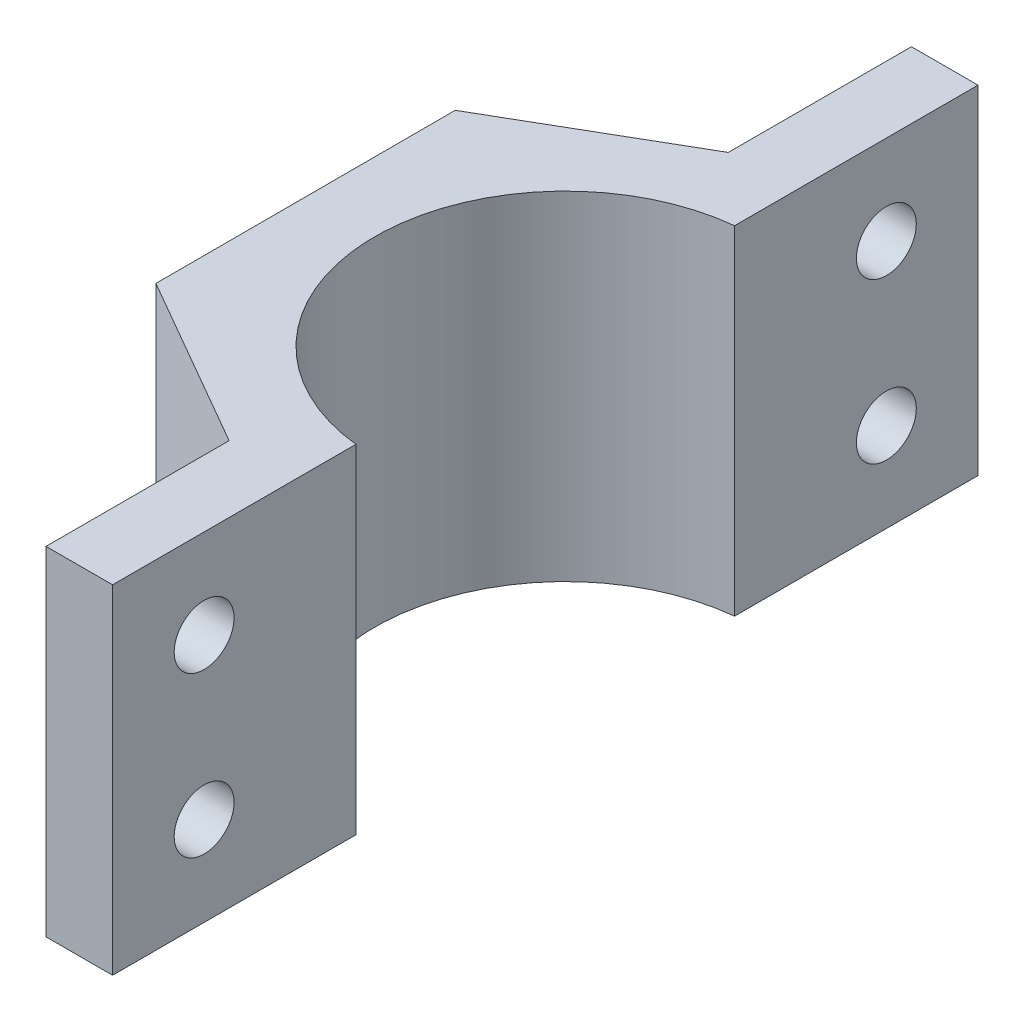
ISO-10303-21;
HEADER;
FILE_DESCRIPTION(('STEP AP214'),'2;1');
FILE_NAME('part.step','',(''),(''),'','','');
FILE_SCHEMA(('AUTOMOTIVE_DESIGN { 1 0 10303 214 1 1 1 1 }'));
ENDSEC;
DATA;
#1=APPLICATION_CONTEXT('core data for automotive mechanical design processes');
#2=APPLICATION_PROTOCOL_DEFINITION('international standard','automotive_design',2000,#1);
#3=PRODUCT_CONTEXT('',#1,'mechanical');
#4=PRODUCT('Part','Part','',(#3));
#5=PRODUCT_RELATED_PRODUCT_CATEGORY('part','',(#4));
#6=PRODUCT_DEFINITION_FORMATION('','',#4);
#7=PRODUCT_DEFINITION_CONTEXT('part definition',#1,'design');
#8=PRODUCT_DEFINITION('design','',#6,#7);
#9=PRODUCT_DEFINITION_SHAPE('','',#8);
#10=(LENGTH_UNIT() NAMED_UNIT(*) SI_UNIT(.MILLI.,.METRE.));
#11=(NAMED_UNIT(*) PLANE_ANGLE_UNIT() SI_UNIT($,.RADIAN.));
#12=(NAMED_UNIT(*) SI_UNIT($,.STERADIAN.) SOLID_ANGLE_UNIT());
#13=UNCERTAINTY_MEASURE_WITH_UNIT(LENGTH_MEASURE(1.E-05),#10,'distance_accuracy_value','');
#14=(GEOMETRIC_REPRESENTATION_CONTEXT(3) GLOBAL_UNCERTAINTY_ASSIGNED_CONTEXT((#13)) GLOBAL_UNIT_ASSIGNED_CONTEXT((#10,
#11,#12)) REPRESENTATION_CONTEXT('',''));
#15=CARTESIAN_POINT('',(0.,0.,0.));
#16=DIRECTION('',(0.,0.,1.));
#17=DIRECTION('',(1.,0.,0.));
#18=AXIS2_PLACEMENT_3D('',#15,#16,#17);
#19=CARTESIAN_POINT('',(0.,25.4,-32.5035075145393));
#20=DIRECTION('',(0.,0.,1.));
#21=DIRECTION('',(1.,0.,0.));
#22=AXIS2_PLACEMENT_3D('',#19,#20,#21);
#23=PLANE('',#22);
#24=DIRECTION('',(-1.,0.,0.));
#25=VECTOR('',#24,1.);
#26=CARTESIAN_POINT('',(0.,0.,-32.5035075145393));
#27=LINE('',#26,#25);
#28=CARTESIAN_POINT('',(-1.5,0.,-32.5035075145393));
#29=VERTEX_POINT('',#28);
#30=CARTESIAN_POINT('',(-6.5,0.,-32.5035075145393));
#31=VERTEX_POINT('',#30);
#32=EDGE_CURVE('E146',#29,#31,#27,.T.);
#33=ORIENTED_EDGE('',*,*,#32,.T.);
#34=DIRECTION('',(0.,-1.,0.));
#35=VECTOR('',#34,1.);
#36=CARTESIAN_POINT('',(-6.5,25.4,-32.5035075145393));
#37=LINE('',#36,#35);
#38=CARTESIAN_POINT('',(-6.5,25.4,-32.5035075145393));
#39=VERTEX_POINT('',#38);
#40=EDGE_CURVE('E11',#39,#31,#37,.T.);
#41=ORIENTED_EDGE('',*,*,#40,.F.);
#42=DIRECTION('',(-1.,0.,0.));
#43=VECTOR('',#42,1.);
#44=CARTESIAN_POINT('',(0.,25.4,-32.5035075145393));
#45=LINE('',#44,#43);
#46=CARTESIAN_POINT('',(-1.5,25.4,-32.5035075145393));
#47=VERTEX_POINT('',#46);
#48=EDGE_CURVE('E169',#47,#39,#45,.T.);
#49=ORIENTED_EDGE('',*,*,#48,.F.);
#50=DIRECTION('',(0.,-1.,0.));
#51=VECTOR('',#50,1.);
#52=CARTESIAN_POINT('',(-1.5,25.4,-32.5035075145393));
#53=LINE('',#52,#51);
#54=EDGE_CURVE('E142',#47,#29,#53,.T.);
#55=ORIENTED_EDGE('',*,*,#54,.T.);
#56=EDGE_LOOP('',(#33,#41,#49,#55));
#57=FACE_BOUND('',#56,.T.);
#58=ADVANCED_FACE('F39',(#57),#23,.F.);
#59=CARTESIAN_POINT('',(-6.5,25.4,0.));
#60=DIRECTION('',(1.,0.,0.));
#61=DIRECTION('',(0.,0.,-1.));
#62=AXIS2_PLACEMENT_3D('',#59,#60,#61);
#63=PLANE('',#62);
#64=CARTESIAN_POINT('',(-6.5,18.7,-25.620108633731));
#65=DIRECTION('',(1.,0.,0.));
#66=DIRECTION('',(0.,0.,-1.));
#67=AXIS2_PLACEMENT_3D('',#64,#65,#66);
#68=CIRCLE('',#67,2.25);
#69=CARTESIAN_POINT('',(-6.5,18.7,-27.870108633731));
#70=VERTEX_POINT('',#69);
#71=EDGE_CURVE('E271',#70,#70,#68,.T.);
#72=ORIENTED_EDGE('',*,*,#71,.T.);
#73=EDGE_LOOP('',(#72));
#74=FACE_BOUND('',#73,.T.);
#75=CARTESIAN_POINT('',(-6.5,6.7,-25.620108633731));
#76=DIRECTION('',(1.,0.,0.));
#77=DIRECTION('',(0.,0.,-1.));
#78=AXIS2_PLACEMENT_3D('',#75,#76,#77);
#79=CIRCLE('',#78,2.25);
#80=CARTESIAN_POINT('',(-6.5,6.7,-27.870108633731));
#81=VERTEX_POINT('',#80);
#82=EDGE_CURVE('E279',#81,#81,#79,.T.);
#83=ORIENTED_EDGE('',*,*,#82,.T.);
#84=EDGE_LOOP('',(#83));
#85=FACE_BOUND('',#84,.T.);
#86=DIRECTION('',(0.,0.,1.));
#87=VECTOR('',#86,1.);
#88=CARTESIAN_POINT('',(-6.5,0.,0.));
#89=LINE('',#88,#87);
#90=CARTESIAN_POINT('',(-6.5,0.,-18.7507398110798));
#91=VERTEX_POINT('',#90);
#92=EDGE_CURVE('E149',#31,#91,#89,.T.);
#93=ORIENTED_EDGE('',*,*,#92,.T.);
#94=DIRECTION('',(0.,-1.,0.));
#95=VECTOR('',#94,1.);
#96=CARTESIAN_POINT('',(-6.5,25.4,-18.7507398110798));
#97=LINE('',#96,#95);
#98=CARTESIAN_POINT('',(-6.5,25.4,-18.7507398110798));
#99=VERTEX_POINT('',#98);
#100=EDGE_CURVE('E47',#99,#91,#97,.T.);
#101=ORIENTED_EDGE('',*,*,#100,.F.);
#102=DIRECTION('',(0.,0.,1.));
#103=VECTOR('',#102,1.);
#104=CARTESIAN_POINT('',(-6.5,25.4,0.));
#105=LINE('',#104,#103);
#106=EDGE_CURVE('E100',#39,#99,#105,.T.);
#107=ORIENTED_EDGE('',*,*,#106,.F.);
#108=ORIENTED_EDGE('',*,*,#40,.T.);
#109=EDGE_LOOP('',(#93,#101,#107,#108));
#110=FACE_BOUND('',#109,.T.);
#111=ADVANCED_FACE('F231',(#74,#85,#110),#63,.F.);
#112=CARTESIAN_POINT('',(-9.75647202403235,25.4,-16.8670908470985));
#113=DIRECTION('',(0.500702377725878,0.,0.865619505868284));
#114=DIRECTION('',(0.865619505868284,0.,-0.500702377725878));
#115=AXIS2_PLACEMENT_3D('',#112,#113,#114);
#116=PLANE('',#115);
#117=DIRECTION('',(-0.865619505868284,0.,0.500702377725878));
#118=VECTOR('',#117,1.);
#119=CARTESIAN_POINT('',(-9.75647202403235,0.,-16.8670908470985));
#120=LINE('',#119,#118);
#121=CARTESIAN_POINT('',(-19.4946914650506,0.,-11.2341890976824));
#122=VERTEX_POINT('',#121);
#123=EDGE_CURVE('E152',#91,#122,#120,.T.);
#124=ORIENTED_EDGE('',*,*,#123,.T.);
#125=DIRECTION('',(0.,-1.,0.));
#126=VECTOR('',#125,1.);
#127=CARTESIAN_POINT('',(-19.4946914650506,25.4,-11.2341890976824));
#128=LINE('',#127,#126);
#129=CARTESIAN_POINT('',(-19.4946914650506,25.4,-11.2341890976824));
#130=VERTEX_POINT('',#129);
#131=EDGE_CURVE('E180',#130,#122,#128,.T.);
#132=ORIENTED_EDGE('',*,*,#131,.F.);
#133=DIRECTION('',(-0.865619505868284,0.,0.500702377725878));
#134=VECTOR('',#133,1.);
#135=CARTESIAN_POINT('',(-9.75647202403235,25.4,-16.8670908470985));
#136=LINE('',#135,#134);
#137=EDGE_CURVE('E188',#99,#130,#136,.T.);
#138=ORIENTED_EDGE('',*,*,#137,.F.);
#139=ORIENTED_EDGE('',*,*,#100,.T.);
#140=EDGE_LOOP('',(#124,#132,#138,#139));
#141=FACE_BOUND('',#140,.T.);
#142=ADVANCED_FACE('F186',(#141),#116,.F.);
#143=CARTESIAN_POINT('',(-19.4855651735435,25.4,0.0158072005749479));
#144=DIRECTION('',(0.999999670956206,0.,-0.000811225911740494));
#145=DIRECTION('',(-0.000811225911740494,0.,-0.999999670956206));
#146=AXIS2_PLACEMENT_3D('',#143,#144,#145);
#147=PLANE('',#146);
#148=DIRECTION('',(0.000811225911740494,0.,0.999999670956206));
#149=VECTOR('',#148,1.);
#150=CARTESIAN_POINT('',(-19.4855651735435,0.,0.0158072005749479));
#151=LINE('',#150,#149);
#152=CARTESIAN_POINT('',(-19.4764388820364,0.,11.2658034988323));
#153=VERTEX_POINT('',#152);
#154=EDGE_CURVE('E154',#122,#153,#151,.T.);
#155=ORIENTED_EDGE('',*,*,#154,.T.);
#156=DIRECTION('',(0.,-1.,0.));
#157=VECTOR('',#156,1.);
#158=CARTESIAN_POINT('',(-19.4764388820364,25.4,11.2658034988323));
#159=LINE('',#158,#157);
#160=CARTESIAN_POINT('',(-19.4764388820364,25.4,11.2658034988323));
#161=VERTEX_POINT('',#160);
#162=EDGE_CURVE('E177',#161,#153,#159,.T.);
#163=ORIENTED_EDGE('',*,*,#162,.F.);
#164=DIRECTION('',(0.000811225911740494,0.,0.999999670956206));
#165=VECTOR('',#164,1.);
#166=CARTESIAN_POINT('',(-19.4855651735435,25.4,0.0158072005749479));
#167=LINE('',#166,#165);
#168=EDGE_CURVE('E205',#130,#161,#167,.T.);
#169=ORIENTED_EDGE('',*,*,#168,.F.);
#170=ORIENTED_EDGE('',*,*,#131,.T.);
#171=EDGE_LOOP('',(#155,#163,#169,#170));
#172=FACE_BOUND('',#171,.T.);
#173=ADVANCED_FACE('F196',(#172),#147,.F.);
#174=CARTESIAN_POINT('',(-9.72909314951112,25.4,16.8828980476734));
#175=DIRECTION('',(0.499297293230328,0.,-0.866430731780024));
#176=DIRECTION('',(-0.866430731780024,0.,-0.499297293230328));
#177=AXIS2_PLACEMENT_3D('',#174,#175,#176);
#178=PLANE('',#177);
#179=DIRECTION('',(0.866430731780024,0.,0.499297293230328));
#180=VECTOR('',#179,1.);
#181=CARTESIAN_POINT('',(-9.72909314951112,0.,16.8828980476734));
#182=LINE('',#181,#180);
#183=CARTESIAN_POINT('',(-6.5,0.,18.7437247820013));
#184=VERTEX_POINT('',#183);
#185=EDGE_CURVE('E156',#153,#184,#182,.T.);
#186=ORIENTED_EDGE('',*,*,#185,.T.);
#187=DIRECTION('',(0.,-1.,0.));
#188=VECTOR('',#187,1.);
#189=CARTESIAN_POINT('',(-6.5,25.4,18.7437247820013));
#190=LINE('',#189,#188);
#191=CARTESIAN_POINT('',(-6.5,25.4,18.7437247820013));
#192=VERTEX_POINT('',#191);
#193=EDGE_CURVE('E175',#192,#184,#190,.T.);
#194=ORIENTED_EDGE('',*,*,#193,.F.);
#195=DIRECTION('',(0.866430731780024,0.,0.499297293230328));
#196=VECTOR('',#195,1.);
#197=CARTESIAN_POINT('',(-9.72909314951112,25.4,16.8828980476734));
#198=LINE('',#197,#196);
#199=EDGE_CURVE('E202',#161,#192,#198,.T.);
#200=ORIENTED_EDGE('',*,*,#199,.F.);
#201=ORIENTED_EDGE('',*,*,#162,.T.);
#202=EDGE_LOOP('',(#186,#194,#200,#201));
#203=FACE_BOUND('',#202,.T.);
#204=ADVANCED_FACE('F200',(#203),#178,.F.);
#205=CARTESIAN_POINT('',(-6.5,25.4,0.));
#206=DIRECTION('',(-1.,0.,0.));
#207=DIRECTION('',(0.,0.,1.));
#208=AXIS2_PLACEMENT_3D('',#205,#206,#207);
#209=PLANE('',#208);
#210=CARTESIAN_POINT('',(-6.5,18.7,25.620108633731));
#211=DIRECTION('',(-1.,0.,0.));
#212=DIRECTION('',(0.,0.,1.));
#213=AXIS2_PLACEMENT_3D('',#210,#211,#212);
#214=CIRCLE('',#213,2.25);
#215=CARTESIAN_POINT('',(-6.5,18.7,27.870108633731));
#216=VERTEX_POINT('',#215);
#217=EDGE_CURVE('E268',#216,#216,#214,.T.);
#218=ORIENTED_EDGE('',*,*,#217,.F.);
#219=EDGE_LOOP('',(#218));
#220=FACE_BOUND('',#219,.T.);
#221=CARTESIAN_POINT('',(-6.5,6.7,25.620108633731));
#222=DIRECTION('',(-1.,0.,0.));
#223=DIRECTION('',(0.,0.,1.));
#224=AXIS2_PLACEMENT_3D('',#221,#222,#223);
#225=CIRCLE('',#224,2.25);
#226=CARTESIAN_POINT('',(-6.5,6.7,27.870108633731));
#227=VERTEX_POINT('',#226);
#228=EDGE_CURVE('E264',#227,#227,#225,.T.);
#229=ORIENTED_EDGE('',*,*,#228,.F.);
#230=EDGE_LOOP('',(#229));
#231=FACE_BOUND('',#230,.T.);
#232=DIRECTION('',(0.,0.,-1.));
#233=VECTOR('',#232,1.);
#234=CARTESIAN_POINT('',(-6.5,0.,0.));
#235=LINE('',#234,#233);
#236=CARTESIAN_POINT('',(-6.5,0.,32.4964924854607));
#237=VERTEX_POINT('',#236);
#238=EDGE_CURVE('E159',#237,#184,#235,.T.);
#239=ORIENTED_EDGE('',*,*,#238,.F.);
#240=DIRECTION('',(0.,-1.,0.));
#241=VECTOR('',#240,1.);
#242=CARTESIAN_POINT('',(-6.5,25.4,32.4964924854607));
#243=LINE('',#242,#241);
#244=CARTESIAN_POINT('',(-6.5,25.4,32.4964924854607));
#245=VERTEX_POINT('',#244);
#246=EDGE_CURVE('E173',#245,#237,#243,.T.);
#247=ORIENTED_EDGE('',*,*,#246,.F.);
#248=DIRECTION('',(0.,0.,-1.));
#249=VECTOR('',#248,1.);
#250=CARTESIAN_POINT('',(-6.5,25.4,0.));
#251=LINE('',#250,#249);
#252=EDGE_CURVE('E204',#245,#192,#251,.T.);
#253=ORIENTED_EDGE('',*,*,#252,.T.);
#254=ORIENTED_EDGE('',*,*,#193,.T.);
#255=EDGE_LOOP('',(#239,#247,#253,#254));
#256=FACE_BOUND('',#255,.T.);
#257=ADVANCED_FACE('F247',(#220,#231,#256),#209,.T.);
#258=CARTESIAN_POINT('',(0.,25.4,32.4964924854607));
#259=DIRECTION('',(0.,0.,1.));
#260=DIRECTION('',(1.,0.,0.));
#261=AXIS2_PLACEMENT_3D('',#258,#259,#260);
#262=PLANE('',#261);
#263=DIRECTION('',(-1.,0.,0.));
#264=VECTOR('',#263,1.);
#265=CARTESIAN_POINT('',(0.,0.,32.4964924854607));
#266=LINE('',#265,#264);
#267=CARTESIAN_POINT('',(-1.5,0.,32.4964924854607));
#268=VERTEX_POINT('',#267);
#269=EDGE_CURVE('E162',#268,#237,#266,.T.);
#270=ORIENTED_EDGE('',*,*,#269,.F.);
#271=DIRECTION('',(0.,-1.,0.));
#272=VECTOR('',#271,1.);
#273=CARTESIAN_POINT('',(-1.5,25.4,32.4964924854607));
#274=LINE('',#273,#272);
#275=CARTESIAN_POINT('',(-1.5,25.4,32.4964924854607));
#276=VERTEX_POINT('',#275);
#277=EDGE_CURVE('E131',#276,#268,#274,.T.);
#278=ORIENTED_EDGE('',*,*,#277,.F.);
#279=DIRECTION('',(-1.,0.,0.));
#280=VECTOR('',#279,1.);
#281=CARTESIAN_POINT('',(0.,25.4,32.4964924854607));
#282=LINE('',#281,#280);
#283=EDGE_CURVE('E138',#276,#245,#282,.T.);
#284=ORIENTED_EDGE('',*,*,#283,.T.);
#285=ORIENTED_EDGE('',*,*,#246,.T.);
#286=EDGE_LOOP('',(#270,#278,#284,#285));
#287=FACE_BOUND('',#286,.T.);
#288=ADVANCED_FACE('F212',(#287),#262,.T.);
#289=CARTESIAN_POINT('',(-1.5,25.4,0.));
#290=DIRECTION('',(1.,0.,0.));
#291=DIRECTION('',(0.,0.,-1.));
#292=AXIS2_PLACEMENT_3D('',#289,#290,#291);
#293=PLANE('',#292);
#294=CARTESIAN_POINT('',(-1.5,18.7,25.620108633731));
#295=DIRECTION('',(-1.,0.,0.));
#296=DIRECTION('',(0.,0.,1.));
#297=AXIS2_PLACEMENT_3D('',#294,#295,#296);
#298=CIRCLE('',#297,2.25);
#299=CARTESIAN_POINT('',(-1.5,18.7,27.870108633731));
#300=VERTEX_POINT('',#299);
#301=EDGE_CURVE('E150',#300,#300,#298,.T.);
#302=ORIENTED_EDGE('',*,*,#301,.T.);
#303=EDGE_LOOP('',(#302));
#304=FACE_BOUND('',#303,.T.);
#305=CARTESIAN_POINT('',(-1.5,6.7,25.620108633731));
#306=DIRECTION('',(-1.,0.,0.));
#307=DIRECTION('',(0.,0.,1.));
#308=AXIS2_PLACEMENT_3D('',#305,#306,#307);
#309=CIRCLE('',#308,2.25);
#310=CARTESIAN_POINT('',(-1.5,6.7,27.870108633731));
#311=VERTEX_POINT('',#310);
#312=EDGE_CURVE('E262',#311,#311,#309,.T.);
#313=ORIENTED_EDGE('',*,*,#312,.T.);
#314=EDGE_LOOP('',(#313));
#315=FACE_BOUND('',#314,.T.);
#316=DIRECTION('',(0.,0.,1.));
#317=VECTOR('',#316,1.);
#318=CARTESIAN_POINT('',(-1.5,0.,0.));
#319=LINE('',#318,#317);
#320=CARTESIAN_POINT('',(-1.5,0.,14.2211110677049));
#321=VERTEX_POINT('',#320);
#322=EDGE_CURVE('E126',#321,#268,#319,.T.);
#323=ORIENTED_EDGE('',*,*,#322,.F.);
#324=DIRECTION('',(0.,-1.,0.));
#325=VECTOR('',#324,1.);
#326=CARTESIAN_POINT('',(-1.5,25.4,14.2211110677049));
#327=LINE('',#326,#325);
#328=CARTESIAN_POINT('',(-1.5,25.4,14.2211110677049));
#329=VERTEX_POINT('',#328);
#330=EDGE_CURVE('E121',#329,#321,#327,.T.);
#331=ORIENTED_EDGE('',*,*,#330,.F.);
#332=DIRECTION('',(0.,0.,1.));
#333=VECTOR('',#332,1.);
#334=CARTESIAN_POINT('',(-1.5,25.4,0.));
#335=LINE('',#334,#333);
#336=EDGE_CURVE('E124',#329,#276,#335,.T.);
#337=ORIENTED_EDGE('',*,*,#336,.T.);
#338=ORIENTED_EDGE('',*,*,#277,.T.);
#339=EDGE_LOOP('',(#323,#331,#337,#338));
#340=FACE_BOUND('',#339,.T.);
#341=ADVANCED_FACE('F123',(#304,#315,#340),#293,.T.);
#342=CARTESIAN_POINT('',(0.,25.4,0.));
#343=DIRECTION('',(0.,-1.,0.));
#344=DIRECTION('',(0.,0.,-1.));
#345=AXIS2_PLACEMENT_3D('',#342,#343,#344);
#346=CYLINDRICAL_SURFACE('',#345,14.3);
#347=CARTESIAN_POINT('',(0.,0.,0.));
#348=DIRECTION('',(0.,1.,0.));
#349=DIRECTION('',(0.,0.,1.));
#350=AXIS2_PLACEMENT_3D('',#347,#348,#349);
#351=CIRCLE('',#350,14.3);
#352=CARTESIAN_POINT('',(-1.5,0.,-14.2211110677049));
#353=VERTEX_POINT('',#352);
#354=EDGE_CURVE('E166',#353,#321,#351,.T.);
#355=ORIENTED_EDGE('',*,*,#354,.F.);
#356=DIRECTION('',(0.,-1.,0.));
#357=VECTOR('',#356,1.);
#358=CARTESIAN_POINT('',(-1.5,25.4,-14.2211110677049));
#359=LINE('',#358,#357);
#360=CARTESIAN_POINT('',(-1.5,25.4,-14.2211110677049));
#361=VERTEX_POINT('',#360);
#362=EDGE_CURVE('E89',#361,#353,#359,.T.);
#363=ORIENTED_EDGE('',*,*,#362,.F.);
#364=CARTESIAN_POINT('',(0.,25.4,0.));
#365=DIRECTION('',(0.,1.,0.));
#366=DIRECTION('',(0.,0.,1.));
#367=AXIS2_PLACEMENT_3D('',#364,#365,#366);
#368=CIRCLE('',#367,14.3);
#369=EDGE_CURVE('E135',#361,#329,#368,.T.);
#370=ORIENTED_EDGE('',*,*,#369,.T.);
#371=ORIENTED_EDGE('',*,*,#330,.T.);
#372=EDGE_LOOP('',(#355,#363,#370,#371));
#373=FACE_BOUND('',#372,.T.);
#374=ADVANCED_FACE('F140',(#373),#346,.F.);
#375=CARTESIAN_POINT('',(-1.5,25.4,0.));
#376=DIRECTION('',(-1.,0.,0.));
#377=DIRECTION('',(0.,0.,1.));
#378=AXIS2_PLACEMENT_3D('',#375,#376,#377);
#379=PLANE('',#378);
#380=CARTESIAN_POINT('',(-1.5,18.7,-25.620108633731));
#381=DIRECTION('',(1.,0.,0.));
#382=DIRECTION('',(0.,0.,-1.));
#383=AXIS2_PLACEMENT_3D('',#380,#381,#382);
#384=CIRCLE('',#383,2.25);
#385=CARTESIAN_POINT('',(-1.5,18.7,-27.870108633731));
#386=VERTEX_POINT('',#385);
#387=EDGE_CURVE('E265',#386,#386,#384,.T.);
#388=ORIENTED_EDGE('',*,*,#387,.F.);
#389=EDGE_LOOP('',(#388));
#390=FACE_BOUND('',#389,.T.);
#391=CARTESIAN_POINT('',(-1.5,6.7,-25.620108633731));
#392=DIRECTION('',(1.,0.,0.));
#393=DIRECTION('',(0.,0.,-1.));
#394=AXIS2_PLACEMENT_3D('',#391,#392,#393);
#395=CIRCLE('',#394,2.25);
#396=CARTESIAN_POINT('',(-1.5,6.7,-27.870108633731));
#397=VERTEX_POINT('',#396);
#398=EDGE_CURVE('E282',#397,#397,#395,.T.);
#399=ORIENTED_EDGE('',*,*,#398,.F.);
#400=EDGE_LOOP('',(#399));
#401=FACE_BOUND('',#400,.T.);
#402=DIRECTION('',(0.,0.,-1.));
#403=VECTOR('',#402,1.);
#404=CARTESIAN_POINT('',(-1.5,0.,0.));
#405=LINE('',#404,#403);
#406=EDGE_CURVE('E92',#353,#29,#405,.T.);
#407=ORIENTED_EDGE('',*,*,#406,.T.);
#408=ORIENTED_EDGE('',*,*,#54,.F.);
#409=DIRECTION('',(0.,0.,-1.));
#410=VECTOR('',#409,1.);
#411=CARTESIAN_POINT('',(-1.5,25.4,0.));
#412=LINE('',#411,#410);
#413=EDGE_CURVE('E55',#361,#47,#412,.T.);
#414=ORIENTED_EDGE('',*,*,#413,.F.);
#415=ORIENTED_EDGE('',*,*,#362,.T.);
#416=EDGE_LOOP('',(#407,#408,#414,#415));
#417=FACE_BOUND('',#416,.T.);
#418=ADVANCED_FACE('F217',(#390,#401,#417),#379,.F.);
#419=CARTESIAN_POINT('',(0.,25.4,0.));
#420=DIRECTION('',(0.,1.,0.));
#421=DIRECTION('',(0.,0.,1.));
#422=AXIS2_PLACEMENT_3D('',#419,#420,#421);
#423=PLANE('',#422);
#424=ORIENTED_EDGE('',*,*,#48,.T.);
#425=ORIENTED_EDGE('',*,*,#106,.T.);
#426=ORIENTED_EDGE('',*,*,#137,.T.);
#427=ORIENTED_EDGE('',*,*,#168,.T.);
#428=ORIENTED_EDGE('',*,*,#199,.T.);
#429=ORIENTED_EDGE('',*,*,#252,.F.);
#430=ORIENTED_EDGE('',*,*,#283,.F.);
#431=ORIENTED_EDGE('',*,*,#336,.F.);
#432=ORIENTED_EDGE('',*,*,#369,.F.);
#433=ORIENTED_EDGE('',*,*,#413,.T.);
#434=EDGE_LOOP('',(#424,#425,#426,#427,#428,#429,#430,#431,#432,#433));
#435=FACE_BOUND('',#434,.T.);
#436=ADVANCED_FACE('F134',(#435),#423,.T.);
#437=CARTESIAN_POINT('',(0.,0.,0.));
#438=DIRECTION('',(0.,1.,0.));
#439=DIRECTION('',(0.,0.,1.));
#440=AXIS2_PLACEMENT_3D('',#437,#438,#439);
#441=PLANE('',#440);
#442=ORIENTED_EDGE('',*,*,#32,.F.);
#443=ORIENTED_EDGE('',*,*,#406,.F.);
#444=ORIENTED_EDGE('',*,*,#354,.T.);
#445=ORIENTED_EDGE('',*,*,#322,.T.);
#446=ORIENTED_EDGE('',*,*,#269,.T.);
#447=ORIENTED_EDGE('',*,*,#238,.T.);
#448=ORIENTED_EDGE('',*,*,#185,.F.);
#449=ORIENTED_EDGE('',*,*,#154,.F.);
#450=ORIENTED_EDGE('',*,*,#123,.F.);
#451=ORIENTED_EDGE('',*,*,#92,.F.);
#452=EDGE_LOOP('',(#442,#443,#444,#445,#446,#447,#448,#449,#450,#451));
#453=FACE_BOUND('',#452,.T.);
#454=ADVANCED_FACE('F192',(#453),#441,.F.);
#455=CARTESIAN_POINT('',(-1.5,6.7,25.620108633731));
#456=DIRECTION('',(-1.,0.,0.));
#457=DIRECTION('',(0.,0.,1.));
#458=AXIS2_PLACEMENT_3D('',#455,#456,#457);
#459=CYLINDRICAL_SURFACE('',#458,2.25);
#460=ORIENTED_EDGE('',*,*,#312,.F.);
#461=EDGE_LOOP('',(#460));
#462=FACE_BOUND('',#461,.T.);
#463=ORIENTED_EDGE('',*,*,#228,.T.);
#464=EDGE_LOOP('',(#463));
#465=FACE_BOUND('',#464,.T.);
#466=ADVANCED_FACE('F301',(#462,#465),#459,.F.);
#467=CARTESIAN_POINT('',(-1.5,18.7,25.620108633731));
#468=DIRECTION('',(-1.,0.,0.));
#469=DIRECTION('',(0.,0.,1.));
#470=AXIS2_PLACEMENT_3D('',#467,#468,#469);
#471=CYLINDRICAL_SURFACE('',#470,2.25);
#472=ORIENTED_EDGE('',*,*,#301,.F.);
#473=EDGE_LOOP('',(#472));
#474=FACE_BOUND('',#473,.T.);
#475=ORIENTED_EDGE('',*,*,#217,.T.);
#476=EDGE_LOOP('',(#475));
#477=FACE_BOUND('',#476,.T.);
#478=ADVANCED_FACE('F295',(#474,#477),#471,.F.);
#479=CARTESIAN_POINT('',(-1.5,6.7,-25.620108633731));
#480=DIRECTION('',(-1.,0.,0.));
#481=DIRECTION('',(0.,0.,1.));
#482=AXIS2_PLACEMENT_3D('',#479,#480,#481);
#483=CYLINDRICAL_SURFACE('',#482,2.25);
#484=ORIENTED_EDGE('',*,*,#398,.T.);
#485=EDGE_LOOP('',(#484));
#486=FACE_BOUND('',#485,.T.);
#487=ORIENTED_EDGE('',*,*,#82,.F.);
#488=EDGE_LOOP('',(#487));
#489=FACE_BOUND('',#488,.T.);
#490=ADVANCED_FACE('F289',(#486,#489),#483,.F.);
#491=CARTESIAN_POINT('',(-1.5,18.7,-25.620108633731));
#492=DIRECTION('',(-1.,0.,0.));
#493=DIRECTION('',(0.,0.,1.));
#494=AXIS2_PLACEMENT_3D('',#491,#492,#493);
#495=CYLINDRICAL_SURFACE('',#494,2.25);
#496=ORIENTED_EDGE('',*,*,#387,.T.);
#497=EDGE_LOOP('',(#496));
#498=FACE_BOUND('',#497,.T.);
#499=ORIENTED_EDGE('',*,*,#71,.F.);
#500=EDGE_LOOP('',(#499));
#501=FACE_BOUND('',#500,.T.);
#502=ADVANCED_FACE('F287',(#498,#501),#495,.F.);
#503=CLOSED_SHELL('',(#58,#111,#142,#173,#204,#257,#288,#341,#374,#418,#436,#454,#466,#478,#490,#502));
#504=MANIFOLD_SOLID_BREP('B2',#503);
#505=ADVANCED_BREP_SHAPE_REPRESENTATION('',(#18,#504),#14);
#506=SHAPE_DEFINITION_REPRESENTATION(#9,#505);
ENDSEC;
END-ISO-10303-21;
